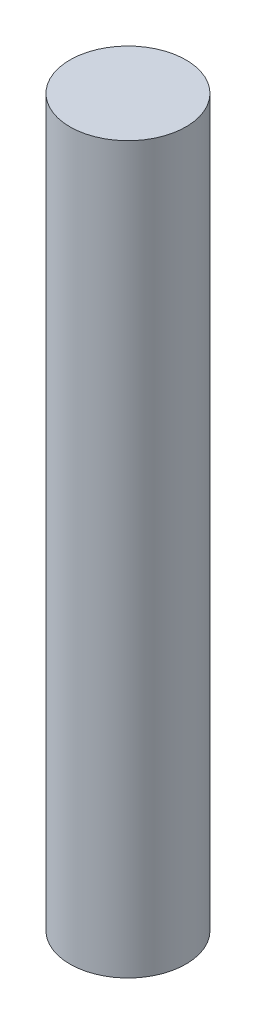
ISO-10303-21;
HEADER;
FILE_DESCRIPTION(('STEP AP214'),'2;1');
FILE_NAME('part.step','',(''),(''),'','','');
FILE_SCHEMA(('AUTOMOTIVE_DESIGN { 1 0 10303 214 1 1 1 1 }'));
ENDSEC;
DATA;
#1=APPLICATION_CONTEXT('core data for automotive mechanical design processes');
#2=APPLICATION_PROTOCOL_DEFINITION('international standard','automotive_design',2000,#1);
#3=PRODUCT_CONTEXT('',#1,'mechanical');
#4=PRODUCT('Part','Part','',(#3));
#5=PRODUCT_RELATED_PRODUCT_CATEGORY('part','',(#4));
#6=PRODUCT_DEFINITION_FORMATION('','',#4);
#7=PRODUCT_DEFINITION_CONTEXT('part definition',#1,'design');
#8=PRODUCT_DEFINITION('design','',#6,#7);
#9=PRODUCT_DEFINITION_SHAPE('','',#8);
#10=(LENGTH_UNIT() NAMED_UNIT(*) SI_UNIT(.MILLI.,.METRE.));
#11=(NAMED_UNIT(*) PLANE_ANGLE_UNIT() SI_UNIT($,.RADIAN.));
#12=(NAMED_UNIT(*) SI_UNIT($,.STERADIAN.) SOLID_ANGLE_UNIT());
#13=UNCERTAINTY_MEASURE_WITH_UNIT(LENGTH_MEASURE(1.E-05),#10,'distance_accuracy_value','');
#14=(GEOMETRIC_REPRESENTATION_CONTEXT(3) GLOBAL_UNCERTAINTY_ASSIGNED_CONTEXT((#13)) GLOBAL_UNIT_ASSIGNED_CONTEXT((#10,
#11,#12)) REPRESENTATION_CONTEXT('',''));
#15=CARTESIAN_POINT('',(0.,0.,0.));
#16=DIRECTION('',(0.,0.,1.));
#17=DIRECTION('',(1.,0.,0.));
#18=AXIS2_PLACEMENT_3D('',#15,#16,#17);
#19=CARTESIAN_POINT('',(0.,79.375,0.));
#20=DIRECTION('',(0.,-1.,0.));
#21=DIRECTION('',(0.,0.,-1.));
#22=AXIS2_PLACEMENT_3D('',#19,#20,#21);
#23=CYLINDRICAL_SURFACE('',#22,6.35);
#24=CARTESIAN_POINT('',(0.,79.375,0.));
#25=DIRECTION('',(0.,1.,0.));
#26=DIRECTION('',(0.,0.,1.));
#27=AXIS2_PLACEMENT_3D('',#24,#25,#26);
#28=CIRCLE('',#27,6.35);
#29=CARTESIAN_POINT('',(0.,79.375,6.35));
#30=VERTEX_POINT('',#29);
#31=EDGE_CURVE('E10',#30,#30,#28,.T.);
#32=ORIENTED_EDGE('',*,*,#31,.F.);
#33=EDGE_LOOP('',(#32));
#34=FACE_BOUND('',#33,.T.);
#35=CARTESIAN_POINT('',(0.,0.,0.));
#36=DIRECTION('',(0.,1.,0.));
#37=DIRECTION('',(0.,0.,1.));
#38=AXIS2_PLACEMENT_3D('',#35,#36,#37);
#39=CIRCLE('',#38,6.35);
#40=CARTESIAN_POINT('',(0.,0.,6.35));
#41=VERTEX_POINT('',#40);
#42=EDGE_CURVE('E34',#41,#41,#39,.T.);
#43=ORIENTED_EDGE('',*,*,#42,.T.);
#44=EDGE_LOOP('',(#43));
#45=FACE_BOUND('',#44,.T.);
#46=ADVANCED_FACE('F31',(#34,#45),#23,.T.);
#47=CARTESIAN_POINT('',(0.,79.375,0.));
#48=DIRECTION('',(0.,1.,0.));
#49=DIRECTION('',(0.,0.,1.));
#50=AXIS2_PLACEMENT_3D('',#47,#48,#49);
#51=PLANE('',#50);
#52=ORIENTED_EDGE('',*,*,#31,.T.);
#53=EDGE_LOOP('',(#52));
#54=FACE_BOUND('',#53,.T.);
#55=ADVANCED_FACE('F60',(#54),#51,.T.);
#56=CARTESIAN_POINT('',(0.,0.,0.));
#57=DIRECTION('',(0.,1.,0.));
#58=DIRECTION('',(0.,0.,1.));
#59=AXIS2_PLACEMENT_3D('',#56,#57,#58);
#60=PLANE('',#59);
#61=CARTESIAN_POINT('',(0.,0.,0.));
#62=DIRECTION('',(0.,-1.,0.));
#63=DIRECTION('',(0.,0.,-1.));
#64=AXIS2_PLACEMENT_3D('',#61,#62,#63);
#65=CIRCLE('',#64,3.889375);
#66=CARTESIAN_POINT('',(0.,0.,-3.889375));
#67=VERTEX_POINT('',#66);
#68=EDGE_CURVE('E43',#67,#67,#65,.T.);
#69=ORIENTED_EDGE('',*,*,#68,.F.);
#70=EDGE_LOOP('',(#69));
#71=FACE_BOUND('',#70,.T.);
#72=ORIENTED_EDGE('',*,*,#42,.F.);
#73=EDGE_LOOP('',(#72));
#74=FACE_BOUND('',#73,.T.);
#75=ADVANCED_FACE('F54',(#71,#74),#60,.F.);
#76=CARTESIAN_POINT('',(0.,31.75,0.));
#77=DIRECTION('',(0.,-1.,0.));
#78=DIRECTION('',(0.,0.,-1.));
#79=AXIS2_PLACEMENT_3D('',#76,#77,#78);
#80=CYLINDRICAL_SURFACE('',#79,3.889375);
#81=CARTESIAN_POINT('',(0.,31.75,0.));
#82=DIRECTION('',(0.,-1.,0.));
#83=DIRECTION('',(0.,0.,-1.));
#84=AXIS2_PLACEMENT_3D('',#81,#82,#83);
#85=CIRCLE('',#84,3.889375);
#86=CARTESIAN_POINT('',(0.,31.75,-3.889375));
#87=VERTEX_POINT('',#86);
#88=EDGE_CURVE('E41',#87,#87,#85,.T.);
#89=ORIENTED_EDGE('',*,*,#88,.F.);
#90=EDGE_LOOP('',(#89));
#91=FACE_BOUND('',#90,.T.);
#92=ORIENTED_EDGE('',*,*,#68,.T.);
#93=EDGE_LOOP('',(#92));
#94=FACE_BOUND('',#93,.T.);
#95=ADVANCED_FACE('F51',(#91,#94),#80,.F.);
#96=CARTESIAN_POINT('',(0.,31.75,0.));
#97=DIRECTION('',(0.,-1.,0.));
#98=DIRECTION('',(0.,0.,-1.));
#99=AXIS2_PLACEMENT_3D('',#96,#97,#98);
#100=PLANE('',#99);
#101=ORIENTED_EDGE('',*,*,#88,.T.);
#102=EDGE_LOOP('',(#101));
#103=FACE_BOUND('',#102,.T.);
#104=ADVANCED_FACE('F49',(#103),#100,.T.);
#105=CLOSED_SHELL('',(#46,#55,#75,#95,#104));
#106=MANIFOLD_SOLID_BREP('B2',#105);
#107=ADVANCED_BREP_SHAPE_REPRESENTATION('',(#18,#106),#14);
#108=SHAPE_DEFINITION_REPRESENTATION(#9,#107);
ENDSEC;
END-ISO-10303-21;
